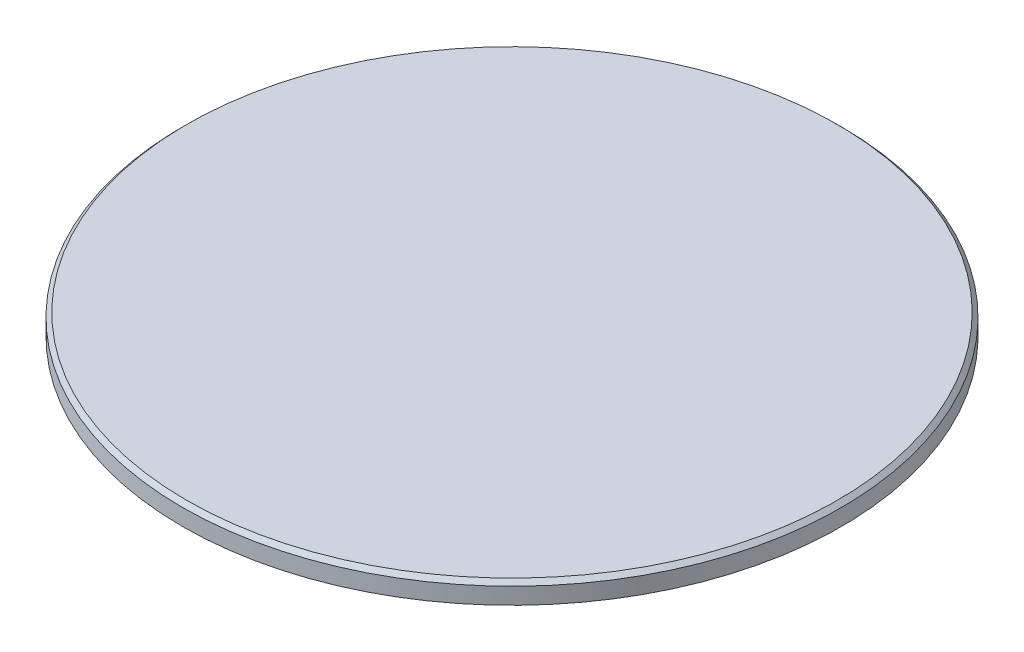
ISO-10303-21;
HEADER;
FILE_DESCRIPTION(('STEP AP214'),'2;1');
FILE_NAME('part.step','',(''),(''),'','','');
FILE_SCHEMA(('AUTOMOTIVE_DESIGN { 1 0 10303 214 1 1 1 1 }'));
ENDSEC;
DATA;
#1=APPLICATION_CONTEXT('core data for automotive mechanical design processes');
#2=APPLICATION_PROTOCOL_DEFINITION('international standard','automotive_design',2000,#1);
#3=PRODUCT_CONTEXT('',#1,'mechanical');
#4=PRODUCT('Part','Part','',(#3));
#5=PRODUCT_RELATED_PRODUCT_CATEGORY('part','',(#4));
#6=PRODUCT_DEFINITION_FORMATION('','',#4);
#7=PRODUCT_DEFINITION_CONTEXT('part definition',#1,'design');
#8=PRODUCT_DEFINITION('design','',#6,#7);
#9=PRODUCT_DEFINITION_SHAPE('','',#8);
#10=(LENGTH_UNIT() NAMED_UNIT(*) SI_UNIT(.MILLI.,.METRE.));
#11=(NAMED_UNIT(*) PLANE_ANGLE_UNIT() SI_UNIT($,.RADIAN.));
#12=(NAMED_UNIT(*) SI_UNIT($,.STERADIAN.) SOLID_ANGLE_UNIT());
#13=UNCERTAINTY_MEASURE_WITH_UNIT(LENGTH_MEASURE(1.E-05),#10,'distance_accuracy_value','');
#14=(GEOMETRIC_REPRESENTATION_CONTEXT(3) GLOBAL_UNCERTAINTY_ASSIGNED_CONTEXT((#13)) GLOBAL_UNIT_ASSIGNED_CONTEXT((#10,
#11,#12)) REPRESENTATION_CONTEXT('',''));
#15=CARTESIAN_POINT('',(0.,0.,0.));
#16=DIRECTION('',(0.,0.,1.));
#17=DIRECTION('',(1.,0.,0.));
#18=AXIS2_PLACEMENT_3D('',#15,#16,#17);
#19=CARTESIAN_POINT('',(0.,1.,0.));
#20=DIRECTION('',(0.,-1.,0.));
#21=DIRECTION('',(0.,0.,-1.));
#22=AXIS2_PLACEMENT_3D('',#19,#20,#21);
#23=CYLINDRICAL_SURFACE('',#22,15.95);
#24=CARTESIAN_POINT('',(0.,0.800000000000008,0.));
#25=DIRECTION('',(0.,1.,0.));
#26=DIRECTION('',(0.,0.,1.));
#27=AXIS2_PLACEMENT_3D('',#24,#25,#26);
#28=CIRCLE('',#27,15.95);
#29=CARTESIAN_POINT('',(0.,0.800000000000008,15.95));
#30=VERTEX_POINT('',#29);
#31=EDGE_CURVE('E10',#30,#30,#28,.F.);
#32=ORIENTED_EDGE('',*,*,#31,.T.);
#33=EDGE_LOOP('',(#32));
#34=FACE_BOUND('',#33,.T.);
#35=CARTESIAN_POINT('',(0.,0.,0.));
#36=DIRECTION('',(0.,1.,0.));
#37=DIRECTION('',(0.,0.,1.));
#38=AXIS2_PLACEMENT_3D('',#35,#36,#37);
#39=CIRCLE('',#38,15.95);
#40=CARTESIAN_POINT('',(0.,0.,15.95));
#41=VERTEX_POINT('',#40);
#42=EDGE_CURVE('E42',#41,#41,#39,.T.);
#43=ORIENTED_EDGE('',*,*,#42,.T.);
#44=EDGE_LOOP('',(#43));
#45=FACE_BOUND('',#44,.T.);
#46=ADVANCED_FACE('F31',(#34,#45),#23,.T.);
#47=CARTESIAN_POINT('',(0.,1.,0.));
#48=DIRECTION('',(0.,1.,0.));
#49=DIRECTION('',(0.,0.,1.));
#50=AXIS2_PLACEMENT_3D('',#47,#48,#49);
#51=PLANE('',#50);
#52=CARTESIAN_POINT('',(0.,1.,0.));
#53=DIRECTION('',(0.,1.,0.));
#54=DIRECTION('',(0.,0.,1.));
#55=AXIS2_PLACEMENT_3D('',#52,#53,#54);
#56=CIRCLE('',#55,15.75);
#57=CARTESIAN_POINT('',(0.,1.,15.75));
#58=VERTEX_POINT('',#57);
#59=EDGE_CURVE('E38',#58,#58,#56,.T.);
#60=ORIENTED_EDGE('',*,*,#59,.T.);
#61=EDGE_LOOP('',(#60));
#62=FACE_BOUND('',#61,.T.);
#63=ADVANCED_FACE('F52',(#62),#51,.T.);
#64=CARTESIAN_POINT('',(0.,0.,0.));
#65=DIRECTION('',(0.,1.,0.));
#66=DIRECTION('',(0.,0.,1.));
#67=AXIS2_PLACEMENT_3D('',#64,#65,#66);
#68=PLANE('',#67);
#69=ORIENTED_EDGE('',*,*,#42,.F.);
#70=EDGE_LOOP('',(#69));
#71=FACE_BOUND('',#70,.T.);
#72=ADVANCED_FACE('F50',(#71),#68,.F.);
#73=CARTESIAN_POINT('',(0.,1.,0.));
#74=DIRECTION('',(0.,-1.,0.));
#75=DIRECTION('',(0.,0.,-1.));
#76=AXIS2_PLACEMENT_3D('',#73,#74,#75);
#77=CONICAL_SURFACE('',#76,15.75,0.785398163397448);
#78=ORIENTED_EDGE('',*,*,#31,.F.);
#79=EDGE_LOOP('',(#78));
#80=FACE_BOUND('',#79,.T.);
#81=ORIENTED_EDGE('',*,*,#59,.F.);
#82=EDGE_LOOP('',(#81));
#83=FACE_BOUND('',#82,.T.);
#84=ADVANCED_FACE('F33',(#80,#83),#77,.T.);
#85=CLOSED_SHELL('',(#46,#63,#72,#84));
#86=MANIFOLD_SOLID_BREP('B2',#85);
#87=ADVANCED_BREP_SHAPE_REPRESENTATION('',(#18,#86),#14);
#88=SHAPE_DEFINITION_REPRESENTATION(#9,#87);
ENDSEC;
END-ISO-10303-21;
